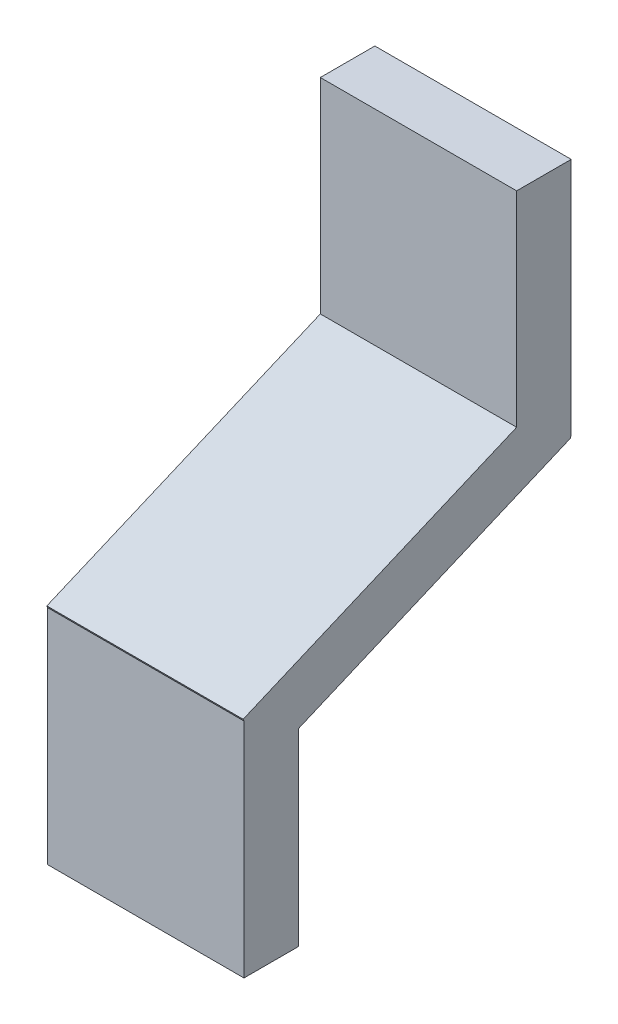
ISO-10303-21;
HEADER;
FILE_DESCRIPTION(('STEP AP214'),'2;1');
FILE_NAME('part.step','',(''),(''),'','','');
FILE_SCHEMA(('AUTOMOTIVE_DESIGN { 1 0 10303 214 1 1 1 1 }'));
ENDSEC;
DATA;
#1=APPLICATION_CONTEXT('core data for automotive mechanical design processes');
#2=APPLICATION_PROTOCOL_DEFINITION('international standard','automotive_design',2000,#1);
#3=PRODUCT_CONTEXT('',#1,'mechanical');
#4=PRODUCT('Part','Part','',(#3));
#5=PRODUCT_RELATED_PRODUCT_CATEGORY('part','',(#4));
#6=PRODUCT_DEFINITION_FORMATION('','',#4);
#7=PRODUCT_DEFINITION_CONTEXT('part definition',#1,'design');
#8=PRODUCT_DEFINITION('design','',#6,#7);
#9=PRODUCT_DEFINITION_SHAPE('','',#8);
#10=(LENGTH_UNIT() NAMED_UNIT(*) SI_UNIT(.MILLI.,.METRE.));
#11=(NAMED_UNIT(*) PLANE_ANGLE_UNIT() SI_UNIT($,.RADIAN.));
#12=(NAMED_UNIT(*) SI_UNIT($,.STERADIAN.) SOLID_ANGLE_UNIT());
#13=UNCERTAINTY_MEASURE_WITH_UNIT(LENGTH_MEASURE(1.E-05),#10,'distance_accuracy_value','');
#14=(GEOMETRIC_REPRESENTATION_CONTEXT(3) GLOBAL_UNCERTAINTY_ASSIGNED_CONTEXT((#13)) GLOBAL_UNIT_ASSIGNED_CONTEXT((#10,
#11,#12)) REPRESENTATION_CONTEXT('',''));
#15=CARTESIAN_POINT('',(0.,0.,0.));
#16=DIRECTION('',(0.,0.,1.));
#17=DIRECTION('',(1.,0.,0.));
#18=AXIS2_PLACEMENT_3D('',#15,#16,#17);
#19=CARTESIAN_POINT('',(3.42,11.,0.5));
#20=DIRECTION('',(0.,0.,1.));
#21=DIRECTION('',(1.,0.,0.));
#22=AXIS2_PLACEMENT_3D('',#19,#20,#21);
#23=PLANE('',#22);
#24=DIRECTION('',(1.,0.,0.));
#25=VECTOR('',#24,1.);
#26=CARTESIAN_POINT('',(3.42,11.3461054439247,0.500000000000314));
#27=LINE('',#26,#25);
#28=CARTESIAN_POINT('',(3.780000014305,11.3461054439242,0.500000000000105));
#29=VERTEX_POINT('',#28);
#30=CARTESIAN_POINT('',(3.42,11.3461054439243,0.500000000000105));
#31=VERTEX_POINT('',#30);
#32=EDGE_CURVE('E148',#29,#31,#27,.F.);
#33=ORIENTED_EDGE('',*,*,#32,.F.);
#34=DIRECTION('',(0.,1.,0.));
#35=VECTOR('',#34,1.);
#36=CARTESIAN_POINT('',(3.780000014305,11.65,0.5));
#37=LINE('',#36,#35);
#38=CARTESIAN_POINT('',(3.780000014305,11.,0.5));
#39=VERTEX_POINT('',#38);
#40=EDGE_CURVE('E154',#39,#29,#37,.T.);
#41=ORIENTED_EDGE('',*,*,#40,.F.);
#42=DIRECTION('',(1.,0.,0.));
#43=VECTOR('',#42,1.);
#44=CARTESIAN_POINT('',(3.42,11.,0.5));
#45=LINE('',#44,#43);
#46=CARTESIAN_POINT('',(3.42,11.,0.5));
#47=VERTEX_POINT('',#46);
#48=EDGE_CURVE('E135',#39,#47,#45,.F.);
#49=ORIENTED_EDGE('',*,*,#48,.T.);
#50=DIRECTION('',(0.,1.,0.));
#51=VECTOR('',#50,1.);
#52=CARTESIAN_POINT('',(3.42,11.65,0.5));
#53=LINE('',#52,#51);
#54=EDGE_CURVE('E182',#47,#31,#53,.T.);
#55=ORIENTED_EDGE('',*,*,#54,.T.);
#56=EDGE_LOOP('',(#33,#41,#49,#55));
#57=FACE_BOUND('',#56,.T.);
#58=ADVANCED_FACE('F17',(#57),#23,.F.);
#59=CARTESIAN_POINT('',(3.42,11.557949520001,0.0009268707435866));
#60=DIRECTION('',(0.,-0.920504786278108,-0.390731286742046));
#61=DIRECTION('',(0.,0.390731286742046,-0.920504786278108));
#62=AXIS2_PLACEMENT_3D('',#59,#60,#61);
#63=PLANE('',#62);
#64=DIRECTION('',(0.,0.39073128674346,-0.920504786277508));
#65=VECTOR('',#64,1.);
#66=CARTESIAN_POINT('',(3.780000014305,11.346105443924,0.5));
#67=LINE('',#66,#65);
#68=CARTESIAN_POINT('',(3.780000014305,11.557949520001,0.000926870743687937));
#69=VERTEX_POINT('',#68);
#70=EDGE_CURVE('E151',#29,#69,#67,.T.);
#71=ORIENTED_EDGE('',*,*,#70,.F.);
#72=ORIENTED_EDGE('',*,*,#32,.T.);
#73=DIRECTION('',(0.,0.39073128674346,-0.920504786277508));
#74=VECTOR('',#73,1.);
#75=CARTESIAN_POINT('',(3.42,11.346105443924,0.5));
#76=LINE('',#75,#74);
#77=CARTESIAN_POINT('',(3.42,11.557949520001,0.000926870743697301));
#78=VERTEX_POINT('',#77);
#79=EDGE_CURVE('E178',#31,#78,#76,.T.);
#80=ORIENTED_EDGE('',*,*,#79,.T.);
#81=DIRECTION('',(1.,0.,0.));
#82=VECTOR('',#81,1.);
#83=CARTESIAN_POINT('',(3.42,11.557949520001,0.00092687074374427));
#84=LINE('',#83,#82);
#85=EDGE_CURVE('E145',#78,#69,#84,.T.);
#86=ORIENTED_EDGE('',*,*,#85,.T.);
#87=EDGE_LOOP('',(#71,#72,#80,#86));
#88=FACE_BOUND('',#87,.T.);
#89=ADVANCED_FACE('F242',(#88),#63,.T.);
#90=CARTESIAN_POINT('',(3.42,11.65,0.04));
#91=DIRECTION('',(0.,-0.390731286742046,0.920504786278108));
#92=DIRECTION('',(0.,-0.920504786278108,-0.390731286742046));
#93=AXIS2_PLACEMENT_3D('',#90,#91,#92);
#94=PLANE('',#93);
#95=DIRECTION('',(0.,0.920504786259214,0.390731286786557));
#96=VECTOR('',#95,1.);
#97=CARTESIAN_POINT('',(3.42,11.557949520001,0.000926870743659899));
#98=LINE('',#97,#96);
#99=CARTESIAN_POINT('',(3.42,11.56,0.001797248280528));
#100=VERTEX_POINT('',#99);
#101=EDGE_CURVE('E123',#78,#100,#98,.T.);
#102=ORIENTED_EDGE('',*,*,#101,.T.);
#103=DIRECTION('',(1.,0.,0.));
#104=VECTOR('',#103,1.);
#105=CARTESIAN_POINT('',(3.42,11.56,0.001797248280528));
#106=LINE('',#105,#104);
#107=CARTESIAN_POINT('',(3.780000014305,11.56,0.001797248280528));
#108=VERTEX_POINT('',#107);
#109=EDGE_CURVE('E97',#100,#108,#106,.T.);
#110=ORIENTED_EDGE('',*,*,#109,.T.);
#111=DIRECTION('',(0.,0.920504786259214,0.390731286786557));
#112=VECTOR('',#111,1.);
#113=CARTESIAN_POINT('',(3.780000014305,11.557949520001,0.000926870743659899));
#114=LINE('',#113,#112);
#115=EDGE_CURVE('E153',#69,#108,#114,.T.);
#116=ORIENTED_EDGE('',*,*,#115,.F.);
#117=ORIENTED_EDGE('',*,*,#85,.F.);
#118=EDGE_LOOP('',(#102,#110,#116,#117));
#119=FACE_BOUND('',#118,.T.);
#120=ADVANCED_FACE('F243',(#119),#94,.F.);
#121=CARTESIAN_POINT('',(3.42,11.56,0.));
#122=DIRECTION('',(0.,1.,0.));
#123=DIRECTION('',(0.,0.,1.));
#124=AXIS2_PLACEMENT_3D('',#121,#122,#123);
#125=PLANE('',#124);
#126=ORIENTED_EDGE('',*,*,#109,.F.);
#127=DIRECTION('',(0.,0.,1.));
#128=VECTOR('',#127,1.);
#129=CARTESIAN_POINT('',(3.42,11.56,0.));
#130=LINE('',#129,#128);
#131=CARTESIAN_POINT('',(3.42,11.56,0.));
#132=VERTEX_POINT('',#131);
#133=EDGE_CURVE('E20',#100,#132,#130,.F.);
#134=ORIENTED_EDGE('',*,*,#133,.T.);
#135=DIRECTION('',(1.,0.,0.));
#136=VECTOR('',#135,1.);
#137=CARTESIAN_POINT('',(3.42,11.56,0.));
#138=LINE('',#137,#136);
#139=CARTESIAN_POINT('',(3.780000014305,11.56,0.));
#140=VERTEX_POINT('',#139);
#141=EDGE_CURVE('E104',#132,#140,#138,.T.);
#142=ORIENTED_EDGE('',*,*,#141,.T.);
#143=DIRECTION('',(0.,0.,-1.));
#144=VECTOR('',#143,1.);
#145=CARTESIAN_POINT('',(3.780000014305,11.56,0.04));
#146=LINE('',#145,#144);
#147=EDGE_CURVE('E194',#108,#140,#146,.T.);
#148=ORIENTED_EDGE('',*,*,#147,.F.);
#149=EDGE_LOOP('',(#126,#134,#142,#148));
#150=FACE_BOUND('',#149,.T.);
#151=ADVANCED_FACE('F122',(#150),#125,.F.);
#152=CARTESIAN_POINT('',(3.42,11.56,0.));
#153=DIRECTION('',(0.,0.,1.));
#154=DIRECTION('',(1.,0.,0.));
#155=AXIS2_PLACEMENT_3D('',#152,#153,#154);
#156=PLANE('',#155);
#157=ORIENTED_EDGE('',*,*,#141,.F.);
#158=DIRECTION('',(0.,1.,0.));
#159=VECTOR('',#158,1.);
#160=CARTESIAN_POINT('',(3.42,11.65,0.));
#161=LINE('',#160,#159);
#162=CARTESIAN_POINT('',(3.42,11.999999997616,0.));
#163=VERTEX_POINT('',#162);
#164=EDGE_CURVE('E108',#132,#163,#161,.T.);
#165=ORIENTED_EDGE('',*,*,#164,.T.);
#166=DIRECTION('',(1.,0.,0.));
#167=VECTOR('',#166,1.);
#168=CARTESIAN_POINT('',(3.42,11.999999997616,0.));
#169=LINE('',#168,#167);
#170=CARTESIAN_POINT('',(3.780000014305,11.999999997616,0.));
#171=VERTEX_POINT('',#170);
#172=EDGE_CURVE('E110',#171,#163,#169,.F.);
#173=ORIENTED_EDGE('',*,*,#172,.F.);
#174=DIRECTION('',(0.,1.,0.));
#175=VECTOR('',#174,1.);
#176=CARTESIAN_POINT('',(3.780000014305,11.65,0.));
#177=LINE('',#176,#175);
#178=EDGE_CURVE('E109',#140,#171,#177,.T.);
#179=ORIENTED_EDGE('',*,*,#178,.F.);
#180=EDGE_LOOP('',(#157,#165,#173,#179));
#181=FACE_BOUND('',#180,.T.);
#182=ADVANCED_FACE('F106',(#181),#156,.F.);
#183=CARTESIAN_POINT('',(3.42,11.999999997616,0.));
#184=DIRECTION('',(0.,1.,0.));
#185=DIRECTION('',(0.,0.,1.));
#186=AXIS2_PLACEMENT_3D('',#183,#184,#185);
#187=PLANE('',#186);
#188=ORIENTED_EDGE('',*,*,#172,.T.);
#189=DIRECTION('',(0.,0.,-1.));
#190=VECTOR('',#189,1.);
#191=CARTESIAN_POINT('',(3.42,11.999999997616,0.04));
#192=LINE('',#191,#190);
#193=CARTESIAN_POINT('',(3.42,11.999999997616,0.10000000149));
#194=VERTEX_POINT('',#193);
#195=EDGE_CURVE('E120',#163,#194,#192,.F.);
#196=ORIENTED_EDGE('',*,*,#195,.T.);
#197=DIRECTION('',(1.,0.,0.));
#198=VECTOR('',#197,1.);
#199=CARTESIAN_POINT('',(3.42,11.999999997616,0.10000000149));
#200=LINE('',#199,#198);
#201=CARTESIAN_POINT('',(3.780000014305,11.999999997616,0.10000000149));
#202=VERTEX_POINT('',#201);
#203=EDGE_CURVE('E181',#202,#194,#200,.F.);
#204=ORIENTED_EDGE('',*,*,#203,.F.);
#205=DIRECTION('',(0.,0.,-1.));
#206=VECTOR('',#205,1.);
#207=CARTESIAN_POINT('',(3.780000014305,11.999999997616,0.04));
#208=LINE('',#207,#206);
#209=EDGE_CURVE('E140',#171,#202,#208,.F.);
#210=ORIENTED_EDGE('',*,*,#209,.F.);
#211=EDGE_LOOP('',(#188,#196,#204,#210));
#212=FACE_BOUND('',#211,.T.);
#213=ADVANCED_FACE('F271',(#212),#187,.T.);
#214=CARTESIAN_POINT('',(3.42,11.,0.60000000149));
#215=DIRECTION('',(0.,0.,1.));
#216=DIRECTION('',(1.,0.,0.));
#217=AXIS2_PLACEMENT_3D('',#214,#215,#216);
#218=PLANE('',#217);
#219=DIRECTION('',(0.,1.,0.));
#220=VECTOR('',#219,1.);
#221=CARTESIAN_POINT('',(3.780000014305,11.65,0.60000000149));
#222=LINE('',#221,#220);
#223=CARTESIAN_POINT('',(3.780000014305,11.408101447657,0.600000001490072));
#224=VERTEX_POINT('',#223);
#225=CARTESIAN_POINT('',(3.780000014305,11.,0.60000000149));
#226=VERTEX_POINT('',#225);
#227=EDGE_CURVE('E168',#224,#226,#222,.F.);
#228=ORIENTED_EDGE('',*,*,#227,.F.);
#229=DIRECTION('',(1.,0.,0.));
#230=VECTOR('',#229,1.);
#231=CARTESIAN_POINT('',(3.42,11.4081014476569,0.600000001490144));
#232=LINE('',#231,#230);
#233=CARTESIAN_POINT('',(3.42,11.408101447657,0.600000001490072));
#234=VERTEX_POINT('',#233);
#235=EDGE_CURVE('E124',#234,#224,#232,.T.);
#236=ORIENTED_EDGE('',*,*,#235,.F.);
#237=DIRECTION('',(0.,1.,0.));
#238=VECTOR('',#237,1.);
#239=CARTESIAN_POINT('',(3.42,11.65,0.60000000149));
#240=LINE('',#239,#238);
#241=CARTESIAN_POINT('',(3.42,11.,0.60000000149));
#242=VERTEX_POINT('',#241);
#243=EDGE_CURVE('E192',#234,#242,#240,.F.);
#244=ORIENTED_EDGE('',*,*,#243,.T.);
#245=DIRECTION('',(1.,0.,0.));
#246=VECTOR('',#245,1.);
#247=CARTESIAN_POINT('',(3.42,11.,0.60000000149));
#248=LINE('',#247,#246);
#249=EDGE_CURVE('E127',#242,#226,#248,.T.);
#250=ORIENTED_EDGE('',*,*,#249,.T.);
#251=EDGE_LOOP('',(#228,#236,#244,#250));
#252=FACE_BOUND('',#251,.T.);
#253=ADVANCED_FACE('F232',(#252),#218,.T.);
#254=CARTESIAN_POINT('',(3.42,11.,0.5));
#255=DIRECTION('',(0.,1.,0.));
#256=DIRECTION('',(0.,0.,1.));
#257=AXIS2_PLACEMENT_3D('',#254,#255,#256);
#258=PLANE('',#257);
#259=DIRECTION('',(0.,0.,-1.));
#260=VECTOR('',#259,1.);
#261=CARTESIAN_POINT('',(3.42,11.,0.04));
#262=LINE('',#261,#260);
#263=EDGE_CURVE('E187',#242,#47,#262,.T.);
#264=ORIENTED_EDGE('',*,*,#263,.T.);
#265=ORIENTED_EDGE('',*,*,#48,.F.);
#266=DIRECTION('',(0.,0.,-1.));
#267=VECTOR('',#266,1.);
#268=CARTESIAN_POINT('',(3.780000014305,11.,0.04));
#269=LINE('',#268,#267);
#270=EDGE_CURVE('E164',#226,#39,#269,.T.);
#271=ORIENTED_EDGE('',*,*,#270,.F.);
#272=ORIENTED_EDGE('',*,*,#249,.F.);
#273=EDGE_LOOP('',(#264,#265,#271,#272));
#274=FACE_BOUND('',#273,.T.);
#275=ADVANCED_FACE('F235',(#274),#258,.F.);
#276=CARTESIAN_POINT('',(3.42,11.411653909498,0.601507932798));
#277=DIRECTION('',(0.,-0.390731286742046,0.920504786278108));
#278=DIRECTION('',(0.,-0.920504786278108,-0.390731286742046));
#279=AXIS2_PLACEMENT_3D('',#276,#277,#278);
#280=PLANE('',#279);
#281=ORIENTED_EDGE('',*,*,#235,.T.);
#282=DIRECTION('',(0.,-0.920504786262243,-0.390731286779422));
#283=VECTOR('',#282,1.);
#284=CARTESIAN_POINT('',(3.780000014305,11.411653909498,0.601507932798));
#285=LINE('',#284,#283);
#286=CARTESIAN_POINT('',(3.780000014305,11.4116539094979,0.601507932797974));
#287=VERTEX_POINT('',#286);
#288=EDGE_CURVE('E227',#287,#224,#285,.T.);
#289=ORIENTED_EDGE('',*,*,#288,.F.);
#290=DIRECTION('',(1.,0.,0.));
#291=VECTOR('',#290,1.);
#292=CARTESIAN_POINT('',(3.42,11.4116539094978,0.601507932797897));
#293=LINE('',#292,#291);
#294=CARTESIAN_POINT('',(3.42,11.4116539094979,0.601507932797974));
#295=VERTEX_POINT('',#294);
#296=EDGE_CURVE('E167',#287,#295,#293,.F.);
#297=ORIENTED_EDGE('',*,*,#296,.T.);
#298=DIRECTION('',(0.,-0.920504786262243,-0.390731286779422));
#299=VECTOR('',#298,1.);
#300=CARTESIAN_POINT('',(3.42,11.411653909498,0.601507932798));
#301=LINE('',#300,#299);
#302=EDGE_CURVE('E175',#295,#234,#301,.T.);
#303=ORIENTED_EDGE('',*,*,#302,.T.);
#304=EDGE_LOOP('',(#281,#289,#297,#303));
#305=FACE_BOUND('',#304,.T.);
#306=ADVANCED_FACE('F210',(#305),#280,.T.);
#307=CARTESIAN_POINT('',(3.42,11.65,0.04));
#308=DIRECTION('',(1.,0.,0.));
#309=DIRECTION('',(0.,0.,-1.));
#310=AXIS2_PLACEMENT_3D('',#307,#308,#309);
#311=PLANE('',#310);
#312=ORIENTED_EDGE('',*,*,#54,.F.);
#313=ORIENTED_EDGE('',*,*,#263,.F.);
#314=ORIENTED_EDGE('',*,*,#243,.F.);
#315=ORIENTED_EDGE('',*,*,#302,.F.);
#316=DIRECTION('',(0.,0.390731286742046,-0.920504786278108));
#317=VECTOR('',#316,1.);
#318=CARTESIAN_POINT('',(3.42,11.65,0.04));
#319=LINE('',#318,#317);
#320=CARTESIAN_POINT('',(3.42,11.624531498221,0.100000001490019));
#321=VERTEX_POINT('',#320);
#322=EDGE_CURVE('E216',#295,#321,#319,.T.);
#323=ORIENTED_EDGE('',*,*,#322,.T.);
#324=DIRECTION('',(0.,1.,0.));
#325=VECTOR('',#324,1.);
#326=CARTESIAN_POINT('',(3.42,11.56,0.10000000149));
#327=LINE('',#326,#325);
#328=EDGE_CURVE('E161',#194,#321,#327,.F.);
#329=ORIENTED_EDGE('',*,*,#328,.F.);
#330=ORIENTED_EDGE('',*,*,#195,.F.);
#331=ORIENTED_EDGE('',*,*,#164,.F.);
#332=ORIENTED_EDGE('',*,*,#133,.F.);
#333=ORIENTED_EDGE('',*,*,#101,.F.);
#334=ORIENTED_EDGE('',*,*,#79,.F.);
#335=EDGE_LOOP('',(#312,#313,#314,#315,#323,#329,#330,#331,#332,#333,#334));
#336=FACE_BOUND('',#335,.T.);
#337=ADVANCED_FACE('F115',(#336),#311,.F.);
#338=CARTESIAN_POINT('',(3.42,11.56,0.10000000149));
#339=DIRECTION('',(0.,0.,1.));
#340=DIRECTION('',(1.,0.,0.));
#341=AXIS2_PLACEMENT_3D('',#338,#339,#340);
#342=PLANE('',#341);
#343=ORIENTED_EDGE('',*,*,#328,.T.);
#344=DIRECTION('',(1.,0.,0.));
#345=VECTOR('',#344,1.);
#346=CARTESIAN_POINT('',(3.42,11.6245314982212,0.100000001490075));
#347=LINE('',#346,#345);
#348=CARTESIAN_POINT('',(3.780000014305,11.624531498221,0.100000001490019));
#349=VERTEX_POINT('',#348);
#350=EDGE_CURVE('E26',#321,#349,#347,.T.);
#351=ORIENTED_EDGE('',*,*,#350,.T.);
#352=DIRECTION('',(0.,1.,0.));
#353=VECTOR('',#352,1.);
#354=CARTESIAN_POINT('',(3.780000014305,11.65,0.10000000149));
#355=LINE('',#354,#353);
#356=EDGE_CURVE('E34',#202,#349,#355,.F.);
#357=ORIENTED_EDGE('',*,*,#356,.F.);
#358=ORIENTED_EDGE('',*,*,#203,.T.);
#359=EDGE_LOOP('',(#343,#351,#357,#358));
#360=FACE_BOUND('',#359,.T.);
#361=ADVANCED_FACE('F257',(#360),#342,.T.);
#362=CARTESIAN_POINT('',(3.780000014305,11.65,0.04));
#363=DIRECTION('',(1.,0.,0.));
#364=DIRECTION('',(0.,0.,-1.));
#365=AXIS2_PLACEMENT_3D('',#362,#363,#364);
#366=PLANE('',#365);
#367=ORIENTED_EDGE('',*,*,#227,.T.);
#368=ORIENTED_EDGE('',*,*,#270,.T.);
#369=ORIENTED_EDGE('',*,*,#40,.T.);
#370=ORIENTED_EDGE('',*,*,#70,.T.);
#371=ORIENTED_EDGE('',*,*,#115,.T.);
#372=ORIENTED_EDGE('',*,*,#147,.T.);
#373=ORIENTED_EDGE('',*,*,#178,.T.);
#374=ORIENTED_EDGE('',*,*,#209,.T.);
#375=ORIENTED_EDGE('',*,*,#356,.T.);
#376=DIRECTION('',(0.,0.390731286742046,-0.920504786278108));
#377=VECTOR('',#376,1.);
#378=CARTESIAN_POINT('',(3.780000014305,11.65,0.04));
#379=LINE('',#378,#377);
#380=EDGE_CURVE('E11',#349,#287,#379,.F.);
#381=ORIENTED_EDGE('',*,*,#380,.T.);
#382=ORIENTED_EDGE('',*,*,#288,.T.);
#383=EDGE_LOOP('',(#367,#368,#369,#370,#371,#372,#373,#374,#375,#381,#382));
#384=FACE_BOUND('',#383,.T.);
#385=ADVANCED_FACE('F230',(#384),#366,.T.);
#386=CARTESIAN_POINT('',(3.42,11.65,0.04));
#387=DIRECTION('',(0.,-0.920504786278108,-0.390731286742046));
#388=DIRECTION('',(0.,0.390731286742046,-0.920504786278108));
#389=AXIS2_PLACEMENT_3D('',#386,#387,#388);
#390=PLANE('',#389);
#391=ORIENTED_EDGE('',*,*,#350,.F.);
#392=ORIENTED_EDGE('',*,*,#322,.F.);
#393=ORIENTED_EDGE('',*,*,#296,.F.);
#394=ORIENTED_EDGE('',*,*,#380,.F.);
#395=EDGE_LOOP('',(#391,#392,#393,#394));
#396=FACE_BOUND('',#395,.T.);
#397=ADVANCED_FACE('F220',(#396),#390,.F.);
#398=CLOSED_SHELL('',(#58,#89,#120,#151,#182,#213,#253,#275,#306,#337,#361,#385,#397));
#399=MANIFOLD_SOLID_BREP('B1',#398);
#400=ADVANCED_BREP_SHAPE_REPRESENTATION('',(#18,#399),#14);
#401=SHAPE_DEFINITION_REPRESENTATION(#9,#400);
ENDSEC;
END-ISO-10303-21;
